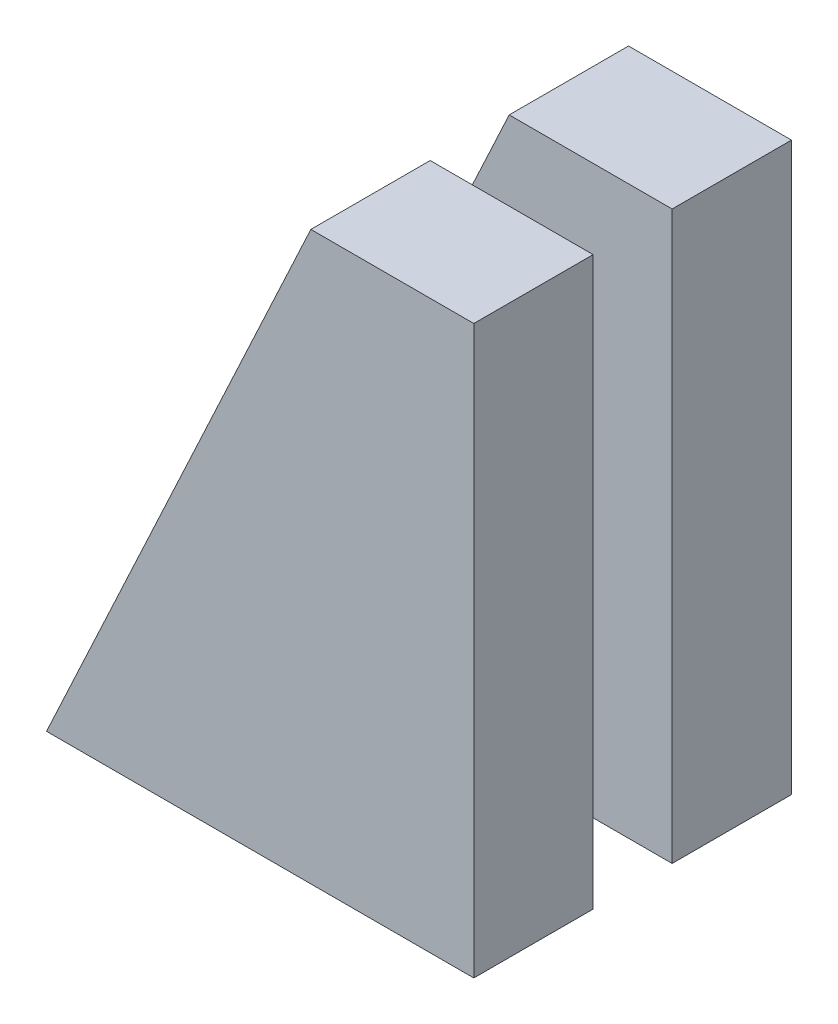
ISO-10303-21;
HEADER;
FILE_DESCRIPTION(('STEP AP214'),'2;1');
FILE_NAME('part.step','',(''),(''),'','','');
FILE_SCHEMA(('AUTOMOTIVE_DESIGN { 1 0 10303 214 1 1 1 1 }'));
ENDSEC;
DATA;
#1=APPLICATION_CONTEXT('core data for automotive mechanical design processes');
#2=APPLICATION_PROTOCOL_DEFINITION('international standard','automotive_design',2000,#1);
#3=PRODUCT_CONTEXT('',#1,'mechanical');
#4=PRODUCT('Part','Part','',(#3));
#5=PRODUCT_RELATED_PRODUCT_CATEGORY('part','',(#4));
#6=PRODUCT_DEFINITION_FORMATION('','',#4);
#7=PRODUCT_DEFINITION_CONTEXT('part definition',#1,'design');
#8=PRODUCT_DEFINITION('design','',#6,#7);
#9=PRODUCT_DEFINITION_SHAPE('','',#8);
#10=(LENGTH_UNIT() NAMED_UNIT(*) SI_UNIT(.MILLI.,.METRE.));
#11=(NAMED_UNIT(*) PLANE_ANGLE_UNIT() SI_UNIT($,.RADIAN.));
#12=(NAMED_UNIT(*) SI_UNIT($,.STERADIAN.) SOLID_ANGLE_UNIT());
#13=UNCERTAINTY_MEASURE_WITH_UNIT(LENGTH_MEASURE(1.E-05),#10,'distance_accuracy_value','');
#14=(GEOMETRIC_REPRESENTATION_CONTEXT(3) GLOBAL_UNCERTAINTY_ASSIGNED_CONTEXT((#13)) GLOBAL_UNIT_ASSIGNED_CONTEXT((#10,
#11,#12)) REPRESENTATION_CONTEXT('',''));
#15=CARTESIAN_POINT('',(0.,0.,0.));
#16=DIRECTION('',(0.,0.,1.));
#17=DIRECTION('',(1.,0.,0.));
#18=AXIS2_PLACEMENT_3D('',#15,#16,#17);
#19=CARTESIAN_POINT('',(-411.7435707686,191.999180245485,372.7));
#20=DIRECTION('',(0.906307787036648,-0.422618261740704,0.));
#21=DIRECTION('',(0.422618261740704,0.906307787036648,0.));
#22=AXIS2_PLACEMENT_3D('',#19,#20,#21);
#23=PLANE('',#22);
#24=DIRECTION('',(-0.422618261740704,-0.906307787036648,0.));
#25=VECTOR('',#24,1.);
#26=CARTESIAN_POINT('',(-411.7435707686,191.999180245485,232.7));
#27=LINE('',#26,#25);
#28=CARTESIAN_POINT('',(-191.179666203475,665.,232.7));
#29=VERTEX_POINT('',#28);
#30=CARTESIAN_POINT('',(-501.274258876553,0.,232.7));
#31=VERTEX_POINT('',#30);
#32=EDGE_CURVE('E108',#29,#31,#27,.T.);
#33=ORIENTED_EDGE('',*,*,#32,.T.);
#34=DIRECTION('',(0.,0.,-1.));
#35=VECTOR('',#34,1.);
#36=CARTESIAN_POINT('',(-501.274258876553,0.,372.7));
#37=LINE('',#36,#35);
#38=CARTESIAN_POINT('',(-501.274258876553,0.,372.7));
#39=VERTEX_POINT('',#38);
#40=EDGE_CURVE('E12',#39,#31,#37,.T.);
#41=ORIENTED_EDGE('',*,*,#40,.F.);
#42=DIRECTION('',(-0.422618261740704,-0.906307787036648,0.));
#43=VECTOR('',#42,1.);
#44=CARTESIAN_POINT('',(-411.7435707686,191.999180245485,372.7));
#45=LINE('',#44,#43);
#46=CARTESIAN_POINT('',(-191.179666203475,665.,372.7));
#47=VERTEX_POINT('',#46);
#48=EDGE_CURVE('E96',#47,#39,#45,.T.);
#49=ORIENTED_EDGE('',*,*,#48,.F.);
#50=DIRECTION('',(0.,0.,-1.));
#51=VECTOR('',#50,1.);
#52=CARTESIAN_POINT('',(-191.179666203475,665.,372.7));
#53=LINE('',#52,#51);
#54=EDGE_CURVE('E104',#47,#29,#53,.T.);
#55=ORIENTED_EDGE('',*,*,#54,.T.);
#56=EDGE_LOOP('',(#33,#41,#49,#55));
#57=FACE_BOUND('',#56,.T.);
#58=ADVANCED_FACE('F45',(#57),#23,.F.);
#59=CARTESIAN_POINT('',(0.,0.,372.7));
#60=DIRECTION('',(0.,1.,0.));
#61=DIRECTION('',(0.,0.,1.));
#62=AXIS2_PLACEMENT_3D('',#59,#60,#61);
#63=PLANE('',#62);
#64=DIRECTION('',(1.,0.,0.));
#65=VECTOR('',#64,1.);
#66=CARTESIAN_POINT('',(0.,0.,232.7));
#67=LINE('',#66,#65);
#68=CARTESIAN_POINT('',(0.,0.,232.7));
#69=VERTEX_POINT('',#68);
#70=EDGE_CURVE('E100',#31,#69,#67,.T.);
#71=ORIENTED_EDGE('',*,*,#70,.T.);
#72=DIRECTION('',(0.,0.,-1.));
#73=VECTOR('',#72,1.);
#74=CARTESIAN_POINT('',(0.,0.,372.7));
#75=LINE('',#74,#73);
#76=CARTESIAN_POINT('',(0.,0.,372.7));
#77=VERTEX_POINT('',#76);
#78=EDGE_CURVE('E53',#77,#69,#75,.T.);
#79=ORIENTED_EDGE('',*,*,#78,.F.);
#80=DIRECTION('',(1.,0.,0.));
#81=VECTOR('',#80,1.);
#82=CARTESIAN_POINT('',(0.,0.,372.7));
#83=LINE('',#82,#81);
#84=EDGE_CURVE('E91',#39,#77,#83,.T.);
#85=ORIENTED_EDGE('',*,*,#84,.F.);
#86=ORIENTED_EDGE('',*,*,#40,.T.);
#87=EDGE_LOOP('',(#71,#79,#85,#86));
#88=FACE_BOUND('',#87,.T.);
#89=ADVANCED_FACE('F99',(#88),#63,.F.);
#90=CARTESIAN_POINT('',(0.,0.,372.7));
#91=DIRECTION('',(-1.,0.,0.));
#92=DIRECTION('',(0.,0.,1.));
#93=AXIS2_PLACEMENT_3D('',#90,#91,#92);
#94=PLANE('',#93);
#95=DIRECTION('',(0.,1.,0.));
#96=VECTOR('',#95,1.);
#97=CARTESIAN_POINT('',(0.,0.,232.7));
#98=LINE('',#97,#96);
#99=CARTESIAN_POINT('',(0.,665.,232.7));
#100=VERTEX_POINT('',#99);
#101=EDGE_CURVE('E78',#69,#100,#98,.T.);
#102=ORIENTED_EDGE('',*,*,#101,.T.);
#103=DIRECTION('',(0.,0.,-1.));
#104=VECTOR('',#103,1.);
#105=CARTESIAN_POINT('',(0.,665.,372.7));
#106=LINE('',#105,#104);
#107=CARTESIAN_POINT('',(0.,665.,372.7));
#108=VERTEX_POINT('',#107);
#109=EDGE_CURVE('E101',#108,#100,#106,.T.);
#110=ORIENTED_EDGE('',*,*,#109,.F.);
#111=DIRECTION('',(0.,1.,0.));
#112=VECTOR('',#111,1.);
#113=CARTESIAN_POINT('',(0.,0.,372.7));
#114=LINE('',#113,#112);
#115=EDGE_CURVE('E94',#77,#108,#114,.T.);
#116=ORIENTED_EDGE('',*,*,#115,.F.);
#117=ORIENTED_EDGE('',*,*,#78,.T.);
#118=EDGE_LOOP('',(#102,#110,#116,#117));
#119=FACE_BOUND('',#118,.T.);
#120=ADVANCED_FACE('F102',(#119),#94,.F.);
#121=CARTESIAN_POINT('',(0.,665.,372.7));
#122=DIRECTION('',(0.,-1.,0.));
#123=DIRECTION('',(0.,0.,-1.));
#124=AXIS2_PLACEMENT_3D('',#121,#122,#123);
#125=PLANE('',#124);
#126=DIRECTION('',(-1.,0.,0.));
#127=VECTOR('',#126,1.);
#128=CARTESIAN_POINT('',(0.,665.,232.7));
#129=LINE('',#128,#127);
#130=EDGE_CURVE('E84',#100,#29,#129,.T.);
#131=ORIENTED_EDGE('',*,*,#130,.T.);
#132=ORIENTED_EDGE('',*,*,#54,.F.);
#133=DIRECTION('',(-1.,0.,0.));
#134=VECTOR('',#133,1.);
#135=CARTESIAN_POINT('',(0.,665.,372.7));
#136=LINE('',#135,#134);
#137=EDGE_CURVE('E61',#108,#47,#136,.T.);
#138=ORIENTED_EDGE('',*,*,#137,.F.);
#139=ORIENTED_EDGE('',*,*,#109,.T.);
#140=EDGE_LOOP('',(#131,#132,#138,#139));
#141=FACE_BOUND('',#140,.T.);
#142=ADVANCED_FACE('F115',(#141),#125,.F.);
#143=CARTESIAN_POINT('',(0.,0.,372.7));
#144=DIRECTION('',(0.,0.,1.));
#145=DIRECTION('',(1.,0.,0.));
#146=AXIS2_PLACEMENT_3D('',#143,#144,#145);
#147=PLANE('',#146);
#148=ORIENTED_EDGE('',*,*,#48,.T.);
#149=ORIENTED_EDGE('',*,*,#84,.T.);
#150=ORIENTED_EDGE('',*,*,#115,.T.);
#151=ORIENTED_EDGE('',*,*,#137,.T.);
#152=EDGE_LOOP('',(#148,#149,#150,#151));
#153=FACE_BOUND('',#152,.T.);
#154=ADVANCED_FACE('F92',(#153),#147,.T.);
#155=CARTESIAN_POINT('',(0.,0.,232.7));
#156=DIRECTION('',(0.,0.,1.));
#157=DIRECTION('',(1.,0.,0.));
#158=AXIS2_PLACEMENT_3D('',#155,#156,#157);
#159=PLANE('',#158);
#160=ORIENTED_EDGE('',*,*,#32,.F.);
#161=ORIENTED_EDGE('',*,*,#130,.F.);
#162=ORIENTED_EDGE('',*,*,#101,.F.);
#163=ORIENTED_EDGE('',*,*,#70,.F.);
#164=EDGE_LOOP('',(#160,#161,#162,#163));
#165=FACE_BOUND('',#164,.T.);
#166=ADVANCED_FACE('F118',(#165),#159,.F.);
#167=CLOSED_SHELL('',(#58,#89,#120,#142,#154,#166));
#168=MANIFOLD_SOLID_BREP('B2',#167);
#169=CARTESIAN_POINT('',(-411.7435707686,191.999180245485,140.));
#170=DIRECTION('',(0.906307787036648,-0.422618261740704,0.));
#171=DIRECTION('',(0.422618261740704,0.906307787036648,0.));
#172=AXIS2_PLACEMENT_3D('',#169,#170,#171);
#173=PLANE('',#172);
#174=DIRECTION('',(-0.422618261740704,-0.906307787036648,0.));
#175=VECTOR('',#174,1.);
#176=CARTESIAN_POINT('',(-411.7435707686,191.999180245485,0.));
#177=LINE('',#176,#175);
#178=CARTESIAN_POINT('',(-191.179666203475,665.,0.));
#179=VERTEX_POINT('',#178);
#180=CARTESIAN_POINT('',(-501.274258876553,0.,0.));
#181=VERTEX_POINT('',#180);
#182=EDGE_CURVE('E244',#179,#181,#177,.T.);
#183=ORIENTED_EDGE('',*,*,#182,.T.);
#184=DIRECTION('',(0.,0.,-1.));
#185=VECTOR('',#184,1.);
#186=CARTESIAN_POINT('',(-501.274258876553,0.,140.));
#187=LINE('',#186,#185);
#188=CARTESIAN_POINT('',(-501.274258876553,0.,140.));
#189=VERTEX_POINT('',#188);
#190=EDGE_CURVE('E43',#189,#181,#187,.T.);
#191=ORIENTED_EDGE('',*,*,#190,.F.);
#192=DIRECTION('',(-0.422618261740704,-0.906307787036648,0.));
#193=VECTOR('',#192,1.);
#194=CARTESIAN_POINT('',(-411.7435707686,191.999180245485,140.));
#195=LINE('',#194,#193);
#196=CARTESIAN_POINT('',(-191.179666203475,665.,140.));
#197=VERTEX_POINT('',#196);
#198=EDGE_CURVE('E232',#197,#189,#195,.T.);
#199=ORIENTED_EDGE('',*,*,#198,.F.);
#200=DIRECTION('',(0.,0.,-1.));
#201=VECTOR('',#200,1.);
#202=CARTESIAN_POINT('',(-191.179666203475,665.,140.));
#203=LINE('',#202,#201);
#204=EDGE_CURVE('E240',#197,#179,#203,.T.);
#205=ORIENTED_EDGE('',*,*,#204,.T.);
#206=EDGE_LOOP('',(#183,#191,#199,#205));
#207=FACE_BOUND('',#206,.T.);
#208=ADVANCED_FACE('F181',(#207),#173,.F.);
#209=CARTESIAN_POINT('',(0.,0.,140.));
#210=DIRECTION('',(0.,1.,0.));
#211=DIRECTION('',(0.,0.,1.));
#212=AXIS2_PLACEMENT_3D('',#209,#210,#211);
#213=PLANE('',#212);
#214=DIRECTION('',(1.,0.,0.));
#215=VECTOR('',#214,1.);
#216=CARTESIAN_POINT('',(0.,0.,0.));
#217=LINE('',#216,#215);
#218=CARTESIAN_POINT('',(0.,0.,0.));
#219=VERTEX_POINT('',#218);
#220=EDGE_CURVE('E236',#181,#219,#217,.T.);
#221=ORIENTED_EDGE('',*,*,#220,.T.);
#222=DIRECTION('',(0.,0.,-1.));
#223=VECTOR('',#222,1.);
#224=CARTESIAN_POINT('',(0.,0.,140.));
#225=LINE('',#224,#223);
#226=CARTESIAN_POINT('',(0.,0.,140.));
#227=VERTEX_POINT('',#226);
#228=EDGE_CURVE('E189',#227,#219,#225,.T.);
#229=ORIENTED_EDGE('',*,*,#228,.F.);
#230=DIRECTION('',(1.,0.,0.));
#231=VECTOR('',#230,1.);
#232=CARTESIAN_POINT('',(0.,0.,140.));
#233=LINE('',#232,#231);
#234=EDGE_CURVE('E227',#189,#227,#233,.T.);
#235=ORIENTED_EDGE('',*,*,#234,.F.);
#236=ORIENTED_EDGE('',*,*,#190,.T.);
#237=EDGE_LOOP('',(#221,#229,#235,#236));
#238=FACE_BOUND('',#237,.T.);
#239=ADVANCED_FACE('F235',(#238),#213,.F.);
#240=CARTESIAN_POINT('',(0.,0.,140.));
#241=DIRECTION('',(-1.,0.,0.));
#242=DIRECTION('',(0.,0.,1.));
#243=AXIS2_PLACEMENT_3D('',#240,#241,#242);
#244=PLANE('',#243);
#245=DIRECTION('',(0.,1.,0.));
#246=VECTOR('',#245,1.);
#247=CARTESIAN_POINT('',(0.,0.,0.));
#248=LINE('',#247,#246);
#249=CARTESIAN_POINT('',(0.,665.,0.));
#250=VERTEX_POINT('',#249);
#251=EDGE_CURVE('E214',#219,#250,#248,.T.);
#252=ORIENTED_EDGE('',*,*,#251,.T.);
#253=DIRECTION('',(0.,0.,-1.));
#254=VECTOR('',#253,1.);
#255=CARTESIAN_POINT('',(0.,665.,140.));
#256=LINE('',#255,#254);
#257=CARTESIAN_POINT('',(0.,665.,140.));
#258=VERTEX_POINT('',#257);
#259=EDGE_CURVE('E237',#258,#250,#256,.T.);
#260=ORIENTED_EDGE('',*,*,#259,.F.);
#261=DIRECTION('',(0.,1.,0.));
#262=VECTOR('',#261,1.);
#263=CARTESIAN_POINT('',(0.,0.,140.));
#264=LINE('',#263,#262);
#265=EDGE_CURVE('E230',#227,#258,#264,.T.);
#266=ORIENTED_EDGE('',*,*,#265,.F.);
#267=ORIENTED_EDGE('',*,*,#228,.T.);
#268=EDGE_LOOP('',(#252,#260,#266,#267));
#269=FACE_BOUND('',#268,.T.);
#270=ADVANCED_FACE('F238',(#269),#244,.F.);
#271=CARTESIAN_POINT('',(0.,665.,140.));
#272=DIRECTION('',(0.,-1.,0.));
#273=DIRECTION('',(0.,0.,-1.));
#274=AXIS2_PLACEMENT_3D('',#271,#272,#273);
#275=PLANE('',#274);
#276=DIRECTION('',(-1.,0.,0.));
#277=VECTOR('',#276,1.);
#278=CARTESIAN_POINT('',(0.,665.,0.));
#279=LINE('',#278,#277);
#280=EDGE_CURVE('E220',#250,#179,#279,.T.);
#281=ORIENTED_EDGE('',*,*,#280,.T.);
#282=ORIENTED_EDGE('',*,*,#204,.F.);
#283=DIRECTION('',(-1.,0.,0.));
#284=VECTOR('',#283,1.);
#285=CARTESIAN_POINT('',(0.,665.,140.));
#286=LINE('',#285,#284);
#287=EDGE_CURVE('E197',#258,#197,#286,.T.);
#288=ORIENTED_EDGE('',*,*,#287,.F.);
#289=ORIENTED_EDGE('',*,*,#259,.T.);
#290=EDGE_LOOP('',(#281,#282,#288,#289));
#291=FACE_BOUND('',#290,.T.);
#292=ADVANCED_FACE('F251',(#291),#275,.F.);
#293=CARTESIAN_POINT('',(0.,0.,140.));
#294=DIRECTION('',(0.,0.,1.));
#295=DIRECTION('',(1.,0.,0.));
#296=AXIS2_PLACEMENT_3D('',#293,#294,#295);
#297=PLANE('',#296);
#298=ORIENTED_EDGE('',*,*,#198,.T.);
#299=ORIENTED_EDGE('',*,*,#234,.T.);
#300=ORIENTED_EDGE('',*,*,#265,.T.);
#301=ORIENTED_EDGE('',*,*,#287,.T.);
#302=EDGE_LOOP('',(#298,#299,#300,#301));
#303=FACE_BOUND('',#302,.T.);
#304=ADVANCED_FACE('F228',(#303),#297,.T.);
#305=CARTESIAN_POINT('',(0.,0.,0.));
#306=DIRECTION('',(0.,0.,1.));
#307=DIRECTION('',(1.,0.,0.));
#308=AXIS2_PLACEMENT_3D('',#305,#306,#307);
#309=PLANE('',#308);
#310=ORIENTED_EDGE('',*,*,#182,.F.);
#311=ORIENTED_EDGE('',*,*,#280,.F.);
#312=ORIENTED_EDGE('',*,*,#251,.F.);
#313=ORIENTED_EDGE('',*,*,#220,.F.);
#314=EDGE_LOOP('',(#310,#311,#312,#313));
#315=FACE_BOUND('',#314,.T.);
#316=ADVANCED_FACE('F254',(#315),#309,.F.);
#317=CLOSED_SHELL('',(#208,#239,#270,#292,#304,#316));
#318=MANIFOLD_SOLID_BREP('B6',#317);
#319=ADVANCED_BREP_SHAPE_REPRESENTATION('',(#18,#168,#318),#14);
#320=SHAPE_DEFINITION_REPRESENTATION(#9,#319);
ENDSEC;
END-ISO-10303-21;
